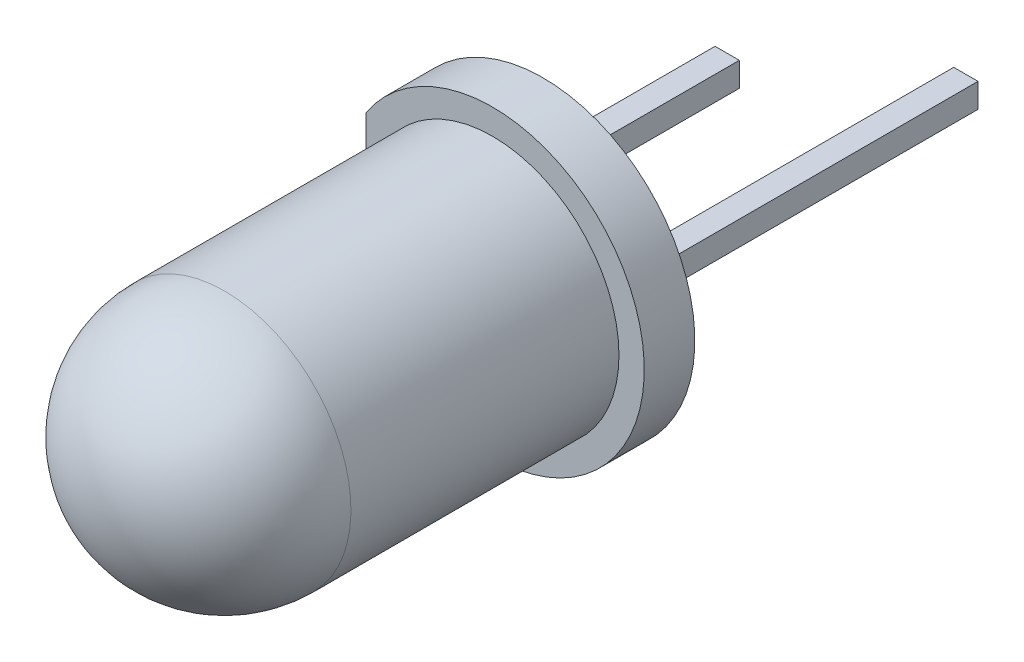
ISO-10303-21;
HEADER;
FILE_DESCRIPTION(('STEP AP214'),'2;1');
FILE_NAME('part.step','',(''),(''),'','','');
FILE_SCHEMA(('AUTOMOTIVE_DESIGN { 1 0 10303 214 1 1 1 1 }'));
ENDSEC;
DATA;
#1=APPLICATION_CONTEXT('core data for automotive mechanical design processes');
#2=APPLICATION_PROTOCOL_DEFINITION('international standard','automotive_design',2000,#1);
#3=PRODUCT_CONTEXT('',#1,'mechanical');
#4=PRODUCT('Part','Part','',(#3));
#5=PRODUCT_RELATED_PRODUCT_CATEGORY('part','',(#4));
#6=PRODUCT_DEFINITION_FORMATION('','',#4);
#7=PRODUCT_DEFINITION_CONTEXT('part definition',#1,'design');
#8=PRODUCT_DEFINITION('design','',#6,#7);
#9=PRODUCT_DEFINITION_SHAPE('','',#8);
#10=(LENGTH_UNIT() NAMED_UNIT(*) SI_UNIT(.MILLI.,.METRE.));
#11=(NAMED_UNIT(*) PLANE_ANGLE_UNIT() SI_UNIT($,.RADIAN.));
#12=(NAMED_UNIT(*) SI_UNIT($,.STERADIAN.) SOLID_ANGLE_UNIT());
#13=UNCERTAINTY_MEASURE_WITH_UNIT(LENGTH_MEASURE(1.E-05),#10,'distance_accuracy_value','');
#14=(GEOMETRIC_REPRESENTATION_CONTEXT(3) GLOBAL_UNCERTAINTY_ASSIGNED_CONTEXT((#13)) GLOBAL_UNIT_ASSIGNED_CONTEXT((#10,
#11,#12)) REPRESENTATION_CONTEXT('',''));
#15=CARTESIAN_POINT('',(0.,0.,0.));
#16=DIRECTION('',(0.,0.,1.));
#17=DIRECTION('',(1.,0.,0.));
#18=AXIS2_PLACEMENT_3D('',#15,#16,#17);
#19=CARTESIAN_POINT('',(-0.0499999999999997,0.,4.26666666666667));
#20=DIRECTION('',(0.,0.,1.));
#21=DIRECTION('',(-1.,0.,0.));
#22=AXIS2_PLACEMENT_3D('',#19,#20,#21);
#23=SPHERICAL_SURFACE('',#22,0.566666666666667);
#24=CARTESIAN_POINT('',(-0.0499999999999997,-0.24,4.26666666666667));
#25=DIRECTION('',(0.,1.,0.));
#26=DIRECTION('',(0.,0.,1.));
#27=AXIS2_PLACEMENT_3D('',#24,#25,#26);
#28=CIRCLE('',#27,0.513333333333333);
#29=CARTESIAN_POINT('',(-0.488634243989226,-0.24,4.));
#30=VERTEX_POINT('',#29);
#31=CARTESIAN_POINT('',(0.388634243989226,-0.24,4.));
#32=VERTEX_POINT('',#31);
#33=EDGE_CURVE('E162',#30,#32,#28,.F.);
#34=ORIENTED_EDGE('',*,*,#33,.T.);
#35=CARTESIAN_POINT('',(-0.0499999999999997,0.,4.));
#36=DIRECTION('',(0.,0.,1.));
#37=DIRECTION('',(1.,0.,0.));
#38=AXIS2_PLACEMENT_3D('',#35,#36,#37);
#39=CIRCLE('',#38,0.5);
#40=EDGE_CURVE('E57',#30,#32,#39,.T.);
#41=ORIENTED_EDGE('',*,*,#40,.F.);
#42=EDGE_LOOP('',(#34,#41));
#43=FACE_BOUND('',#42,.T.);
#44=ADVANCED_FACE('F49',(#43),#23,.T.);
#45=CARTESIAN_POINT('',(0.388634243989226,0.24,4.));
#46=VERTEX_POINT('',#45);
#47=CARTESIAN_POINT('',(-0.488634243989226,0.24,4.));
#48=VERTEX_POINT('',#47);
#49=EDGE_CURVE('E12',#46,#48,#39,.T.);
#50=ORIENTED_EDGE('',*,*,#49,.F.);
#51=CARTESIAN_POINT('',(-0.0499999999999997,0.24,4.26666666666667));
#52=DIRECTION('',(0.,1.,0.));
#53=DIRECTION('',(0.,0.,1.));
#54=AXIS2_PLACEMENT_3D('',#51,#52,#53);
#55=CIRCLE('',#54,0.513333333333333);
#56=EDGE_CURVE('E184',#48,#46,#55,.F.);
#57=ORIENTED_EDGE('',*,*,#56,.F.);
#58=EDGE_LOOP('',(#50,#57));
#59=FACE_BOUND('',#58,.T.);
#60=ADVANCED_FACE('F51',(#59),#23,.T.);
#61=CARTESIAN_POINT('',(-0.55,0.,4.));
#62=DIRECTION('',(0.,0.,-1.));
#63=DIRECTION('',(-1.,0.,0.));
#64=AXIS2_PLACEMENT_3D('',#61,#62,#63);
#65=PLANE('',#64);
#66=CARTESIAN_POINT('',(-0.0499999999999997,0.,4.));
#67=DIRECTION('',(0.,0.,1.));
#68=DIRECTION('',(1.,0.,0.));
#69=AXIS2_PLACEMENT_3D('',#66,#67,#68);
#70=CIRCLE('',#69,0.2);
#71=CARTESIAN_POINT('',(0.15,0.,4.));
#72=VERTEX_POINT('',#71);
#73=EDGE_CURVE('E257',#72,#72,#70,.T.);
#74=ORIENTED_EDGE('',*,*,#73,.F.);
#75=EDGE_LOOP('',(#74));
#76=FACE_BOUND('',#75,.T.);
#77=ORIENTED_EDGE('',*,*,#49,.T.);
#78=DIRECTION('',(1.,0.,0.));
#79=VECTOR('',#78,1.);
#80=CARTESIAN_POINT('',(-1.3,0.24,4.));
#81=LINE('',#80,#79);
#82=CARTESIAN_POINT('',(-1.3,0.24,4.));
#83=VERTEX_POINT('',#82);
#84=EDGE_CURVE('E103',#83,#48,#81,.T.);
#85=ORIENTED_EDGE('',*,*,#84,.F.);
#86=DIRECTION('',(0.,-1.,0.));
#87=VECTOR('',#86,1.);
#88=CARTESIAN_POINT('',(-1.3,0.24,4.));
#89=LINE('',#88,#87);
#90=CARTESIAN_POINT('',(-1.3,-0.24,4.));
#91=VERTEX_POINT('',#90);
#92=EDGE_CURVE('E161',#83,#91,#89,.T.);
#93=ORIENTED_EDGE('',*,*,#92,.T.);
#94=DIRECTION('',(1.,0.,0.));
#95=VECTOR('',#94,1.);
#96=CARTESIAN_POINT('',(-1.3,-0.24,4.));
#97=LINE('',#96,#95);
#98=EDGE_CURVE('E64',#91,#30,#97,.T.);
#99=ORIENTED_EDGE('',*,*,#98,.T.);
#100=ORIENTED_EDGE('',*,*,#40,.T.);
#101=CARTESIAN_POINT('',(1.2,-0.24,4.));
#102=VERTEX_POINT('',#101);
#103=EDGE_CURVE('E147',#32,#102,#97,.T.);
#104=ORIENTED_EDGE('',*,*,#103,.T.);
#105=DIRECTION('',(0.,-1.,0.));
#106=VECTOR('',#105,1.);
#107=CARTESIAN_POINT('',(1.2,0.24,4.));
#108=LINE('',#107,#106);
#109=CARTESIAN_POINT('',(1.2,0.24,4.));
#110=VERTEX_POINT('',#109);
#111=EDGE_CURVE('E131',#110,#102,#108,.T.);
#112=ORIENTED_EDGE('',*,*,#111,.F.);
#113=EDGE_CURVE('E119',#46,#110,#81,.T.);
#114=ORIENTED_EDGE('',*,*,#113,.F.);
#115=EDGE_LOOP('',(#77,#85,#93,#99,#100,#104,#112,#114));
#116=FACE_BOUND('',#115,.T.);
#117=ADVANCED_FACE('F167',(#76,#116),#65,.F.);
#118=CARTESIAN_POINT('',(0.,0.24,0.));
#119=DIRECTION('',(0.,1.,0.));
#120=DIRECTION('',(0.,0.,1.));
#121=AXIS2_PLACEMENT_3D('',#118,#119,#120);
#122=PLANE('',#121);
#123=ORIENTED_EDGE('',*,*,#84,.T.);
#124=ORIENTED_EDGE('',*,*,#56,.T.);
#125=ORIENTED_EDGE('',*,*,#113,.T.);
#126=DIRECTION('',(-0.508148861978286,0.,-0.861269257590315));
#127=VECTOR('',#126,1.);
#128=CARTESIAN_POINT('',(1.2,0.24,4.));
#129=LINE('',#128,#127);
#130=CARTESIAN_POINT('',(0.0199999999999998,0.24,2.));
#131=VERTEX_POINT('',#130);
#132=EDGE_CURVE('E110',#110,#131,#129,.T.);
#133=ORIENTED_EDGE('',*,*,#132,.T.);
#134=DIRECTION('',(-1.,0.,0.));
#135=VECTOR('',#134,1.);
#136=CARTESIAN_POINT('',(0.0199999999999998,0.24,2.));
#137=LINE('',#136,#135);
#138=CARTESIAN_POINT('',(-1.12,0.24,2.));
#139=VERTEX_POINT('',#138);
#140=EDGE_CURVE('E115',#131,#139,#137,.T.);
#141=ORIENTED_EDGE('',*,*,#140,.T.);
#142=DIRECTION('',(0.,0.,-1.));
#143=VECTOR('',#142,1.);
#144=CARTESIAN_POINT('',(-1.12,0.24,2.));
#145=LINE('',#144,#143);
#146=CARTESIAN_POINT('',(-1.12,0.24,-5.));
#147=VERTEX_POINT('',#146);
#148=EDGE_CURVE('E137',#139,#147,#145,.T.);
#149=ORIENTED_EDGE('',*,*,#148,.T.);
#150=DIRECTION('',(1.,0.,0.));
#151=VECTOR('',#150,1.);
#152=CARTESIAN_POINT('',(-1.12,0.24,-5.));
#153=LINE('',#152,#151);
#154=CARTESIAN_POINT('',(-1.6,0.24,-5.));
#155=VERTEX_POINT('',#154);
#156=EDGE_CURVE('E148',#155,#147,#153,.T.);
#157=ORIENTED_EDGE('',*,*,#156,.F.);
#158=DIRECTION('',(0.,0.,1.));
#159=VECTOR('',#158,1.);
#160=CARTESIAN_POINT('',(-1.6,0.24,0.));
#161=LINE('',#160,#159);
#162=CARTESIAN_POINT('',(-1.6,0.24,3.5));
#163=VERTEX_POINT('',#162);
#164=EDGE_CURVE('E73',#155,#163,#161,.T.);
#165=ORIENTED_EDGE('',*,*,#164,.T.);
#166=DIRECTION('',(0.514495755427526,0.,0.857492925712544));
#167=VECTOR('',#166,1.);
#168=CARTESIAN_POINT('',(-1.6,0.24,3.5));
#169=LINE('',#168,#167);
#170=EDGE_CURVE('E157',#163,#83,#169,.T.);
#171=ORIENTED_EDGE('',*,*,#170,.T.);
#172=EDGE_LOOP('',(#123,#124,#125,#133,#141,#149,#157,#165,#171));
#173=FACE_BOUND('',#172,.T.);
#174=ADVANCED_FACE('F112',(#173),#122,.T.);
#175=CARTESIAN_POINT('',(0.,-0.24,0.));
#176=DIRECTION('',(0.,1.,0.));
#177=DIRECTION('',(0.,0.,1.));
#178=AXIS2_PLACEMENT_3D('',#175,#176,#177);
#179=PLANE('',#178);
#180=ORIENTED_EDGE('',*,*,#33,.F.);
#181=ORIENTED_EDGE('',*,*,#98,.F.);
#182=DIRECTION('',(0.514495755427526,0.,0.857492925712544));
#183=VECTOR('',#182,1.);
#184=CARTESIAN_POINT('',(-1.6,-0.24,3.5));
#185=LINE('',#184,#183);
#186=CARTESIAN_POINT('',(-1.6,-0.24,3.5));
#187=VERTEX_POINT('',#186);
#188=EDGE_CURVE('E144',#187,#91,#185,.T.);
#189=ORIENTED_EDGE('',*,*,#188,.F.);
#190=DIRECTION('',(0.,0.,1.));
#191=VECTOR('',#190,1.);
#192=CARTESIAN_POINT('',(-1.6,-0.24,0.));
#193=LINE('',#192,#191);
#194=CARTESIAN_POINT('',(-1.6,-0.24,-5.));
#195=VERTEX_POINT('',#194);
#196=EDGE_CURVE('E97',#195,#187,#193,.T.);
#197=ORIENTED_EDGE('',*,*,#196,.F.);
#198=DIRECTION('',(-1.,0.,0.));
#199=VECTOR('',#198,1.);
#200=CARTESIAN_POINT('',(-1.12,-0.24,-5.));
#201=LINE('',#200,#199);
#202=CARTESIAN_POINT('',(-1.12,-0.24,-5.));
#203=VERTEX_POINT('',#202);
#204=EDGE_CURVE('E205',#203,#195,#201,.T.);
#205=ORIENTED_EDGE('',*,*,#204,.F.);
#206=DIRECTION('',(0.,0.,-1.));
#207=VECTOR('',#206,1.);
#208=CARTESIAN_POINT('',(-1.12,-0.24,2.));
#209=LINE('',#208,#207);
#210=CARTESIAN_POINT('',(-1.12,-0.24,2.));
#211=VERTEX_POINT('',#210);
#212=EDGE_CURVE('E153',#211,#203,#209,.T.);
#213=ORIENTED_EDGE('',*,*,#212,.F.);
#214=DIRECTION('',(-1.,0.,0.));
#215=VECTOR('',#214,1.);
#216=CARTESIAN_POINT('',(0.0199999999999998,-0.24,2.));
#217=LINE('',#216,#215);
#218=CARTESIAN_POINT('',(0.0199999999999998,-0.24,2.));
#219=VERTEX_POINT('',#218);
#220=EDGE_CURVE('E151',#219,#211,#217,.T.);
#221=ORIENTED_EDGE('',*,*,#220,.F.);
#222=DIRECTION('',(-0.508148861978286,0.,-0.861269257590315));
#223=VECTOR('',#222,1.);
#224=CARTESIAN_POINT('',(1.2,-0.24,4.));
#225=LINE('',#224,#223);
#226=EDGE_CURVE('E128',#102,#219,#225,.T.);
#227=ORIENTED_EDGE('',*,*,#226,.F.);
#228=ORIENTED_EDGE('',*,*,#103,.F.);
#229=EDGE_LOOP('',(#180,#181,#189,#197,#205,#213,#221,#227,#228));
#230=FACE_BOUND('',#229,.T.);
#231=ADVANCED_FACE('F219',(#230),#179,.F.);
#232=CARTESIAN_POINT('',(-1.6,0.24,3.5));
#233=DIRECTION('',(0.857492925712544,0.,-0.514495755427526));
#234=DIRECTION('',(-0.514495755427526,0.,-0.857492925712544));
#235=AXIS2_PLACEMENT_3D('',#232,#233,#234);
#236=PLANE('',#235);
#237=ORIENTED_EDGE('',*,*,#188,.T.);
#238=ORIENTED_EDGE('',*,*,#92,.F.);
#239=ORIENTED_EDGE('',*,*,#170,.F.);
#240=DIRECTION('',(0.,-1.,0.));
#241=VECTOR('',#240,1.);
#242=CARTESIAN_POINT('',(-1.6,0.24,3.5));
#243=LINE('',#242,#241);
#244=EDGE_CURVE('E143',#163,#187,#243,.T.);
#245=ORIENTED_EDGE('',*,*,#244,.T.);
#246=EDGE_LOOP('',(#237,#238,#239,#245));
#247=FACE_BOUND('',#246,.T.);
#248=ADVANCED_FACE('F216',(#247),#236,.F.);
#249=CARTESIAN_POINT('',(1.2,0.24,4.));
#250=DIRECTION('',(-0.861269257590315,0.,0.508148861978286));
#251=DIRECTION('',(0.508148861978286,0.,0.861269257590315));
#252=AXIS2_PLACEMENT_3D('',#249,#250,#251);
#253=PLANE('',#252);
#254=ORIENTED_EDGE('',*,*,#226,.T.);
#255=DIRECTION('',(0.,-1.,0.));
#256=VECTOR('',#255,1.);
#257=CARTESIAN_POINT('',(0.0199999999999998,0.24,2.));
#258=LINE('',#257,#256);
#259=EDGE_CURVE('E125',#131,#219,#258,.T.);
#260=ORIENTED_EDGE('',*,*,#259,.F.);
#261=ORIENTED_EDGE('',*,*,#132,.F.);
#262=ORIENTED_EDGE('',*,*,#111,.T.);
#263=EDGE_LOOP('',(#254,#260,#261,#262));
#264=FACE_BOUND('',#263,.T.);
#265=ADVANCED_FACE('F126',(#264),#253,.F.);
#266=CARTESIAN_POINT('',(0.0199999999999998,0.24,2.));
#267=DIRECTION('',(0.,0.,1.));
#268=DIRECTION('',(1.,0.,0.));
#269=AXIS2_PLACEMENT_3D('',#266,#267,#268);
#270=PLANE('',#269);
#271=ORIENTED_EDGE('',*,*,#220,.T.);
#272=DIRECTION('',(0.,-1.,0.));
#273=VECTOR('',#272,1.);
#274=CARTESIAN_POINT('',(-1.12,0.24,2.));
#275=LINE('',#274,#273);
#276=EDGE_CURVE('E132',#139,#211,#275,.T.);
#277=ORIENTED_EDGE('',*,*,#276,.F.);
#278=ORIENTED_EDGE('',*,*,#140,.F.);
#279=ORIENTED_EDGE('',*,*,#259,.T.);
#280=EDGE_LOOP('',(#271,#277,#278,#279));
#281=FACE_BOUND('',#280,.T.);
#282=ADVANCED_FACE('F134',(#281),#270,.F.);
#283=CARTESIAN_POINT('',(-1.12,0.24,2.));
#284=DIRECTION('',(-1.,0.,0.));
#285=DIRECTION('',(0.,0.,1.));
#286=AXIS2_PLACEMENT_3D('',#283,#284,#285);
#287=PLANE('',#286);
#288=ORIENTED_EDGE('',*,*,#212,.T.);
#289=DIRECTION('',(0.,-1.,0.));
#290=VECTOR('',#289,1.);
#291=CARTESIAN_POINT('',(-1.12,-0.24,-5.));
#292=LINE('',#291,#290);
#293=EDGE_CURVE('E199',#147,#203,#292,.T.);
#294=ORIENTED_EDGE('',*,*,#293,.F.);
#295=ORIENTED_EDGE('',*,*,#148,.F.);
#296=ORIENTED_EDGE('',*,*,#276,.T.);
#297=EDGE_LOOP('',(#288,#294,#295,#296));
#298=FACE_BOUND('',#297,.T.);
#299=ADVANCED_FACE('F202',(#298),#287,.F.);
#300=CARTESIAN_POINT('',(-1.6,0.24,0.));
#301=DIRECTION('',(1.,0.,0.));
#302=DIRECTION('',(0.,0.,-1.));
#303=AXIS2_PLACEMENT_3D('',#300,#301,#302);
#304=PLANE('',#303);
#305=ORIENTED_EDGE('',*,*,#196,.T.);
#306=ORIENTED_EDGE('',*,*,#244,.F.);
#307=ORIENTED_EDGE('',*,*,#164,.F.);
#308=DIRECTION('',(0.,1.,0.));
#309=VECTOR('',#308,1.);
#310=CARTESIAN_POINT('',(-1.6,-0.24,-5.));
#311=LINE('',#310,#309);
#312=EDGE_CURVE('E200',#195,#155,#311,.T.);
#313=ORIENTED_EDGE('',*,*,#312,.F.);
#314=EDGE_LOOP('',(#305,#306,#307,#313));
#315=FACE_BOUND('',#314,.T.);
#316=ADVANCED_FACE('F220',(#315),#304,.F.);
#317=CARTESIAN_POINT('',(0.,0.,-5.));
#318=DIRECTION('',(0.,0.,1.));
#319=DIRECTION('',(1.,0.,0.));
#320=AXIS2_PLACEMENT_3D('',#317,#318,#319);
#321=PLANE('',#320);
#322=ORIENTED_EDGE('',*,*,#293,.T.);
#323=ORIENTED_EDGE('',*,*,#204,.T.);
#324=ORIENTED_EDGE('',*,*,#312,.T.);
#325=ORIENTED_EDGE('',*,*,#156,.T.);
#326=EDGE_LOOP('',(#322,#323,#324,#325));
#327=FACE_BOUND('',#326,.T.);
#328=ADVANCED_FACE('F197',(#327),#321,.F.);
#329=CARTESIAN_POINT('',(-0.0499999999999997,0.,3.9));
#330=DIRECTION('',(0.,0.,1.));
#331=DIRECTION('',(1.,0.,0.));
#332=AXIS2_PLACEMENT_3D('',#329,#330,#331);
#333=CYLINDRICAL_SURFACE('',#332,0.2);
#334=CARTESIAN_POINT('',(-0.0499999999999997,0.,3.9));
#335=DIRECTION('',(0.,0.,1.));
#336=DIRECTION('',(1.,0.,0.));
#337=AXIS2_PLACEMENT_3D('',#334,#335,#336);
#338=CIRCLE('',#337,0.2);
#339=CARTESIAN_POINT('',(0.15,0.,3.9));
#340=VERTEX_POINT('',#339);
#341=EDGE_CURVE('E208',#340,#340,#338,.T.);
#342=ORIENTED_EDGE('',*,*,#341,.F.);
#343=EDGE_LOOP('',(#342));
#344=FACE_BOUND('',#343,.T.);
#345=ORIENTED_EDGE('',*,*,#73,.T.);
#346=EDGE_LOOP('',(#345));
#347=FACE_BOUND('',#346,.T.);
#348=ADVANCED_FACE('F227',(#344,#347),#333,.F.);
#349=CARTESIAN_POINT('',(-0.0499999999999997,0.,3.9));
#350=DIRECTION('',(0.,0.,1.));
#351=DIRECTION('',(1.,0.,0.));
#352=AXIS2_PLACEMENT_3D('',#349,#350,#351);
#353=PLANE('',#352);
#354=ORIENTED_EDGE('',*,*,#341,.T.);
#355=EDGE_LOOP('',(#354));
#356=FACE_BOUND('',#355,.T.);
#357=ADVANCED_FACE('F249',(#356),#353,.T.);
#358=CLOSED_SHELL('',(#44,#60,#117,#174,#231,#248,#265,#282,#299,#316,#328,#348,#357));
#359=MANIFOLD_SOLID_BREP('B2',#358);
#360=CARTESIAN_POINT('',(1.12,0.24,2.));
#361=DIRECTION('',(0.,0.,1.));
#362=DIRECTION('',(1.,0.,0.));
#363=AXIS2_PLACEMENT_3D('',#360,#361,#362);
#364=PLANE('',#363);
#365=DIRECTION('',(-1.,0.,0.));
#366=VECTOR('',#365,1.);
#367=CARTESIAN_POINT('',(1.12,-0.24,2.));
#368=LINE('',#367,#366);
#369=CARTESIAN_POINT('',(1.12,-0.24,2.));
#370=VERTEX_POINT('',#369);
#371=CARTESIAN_POINT('',(0.22,-0.24,2.));
#372=VERTEX_POINT('',#371);
#373=EDGE_CURVE('E454',#370,#372,#368,.T.);
#374=ORIENTED_EDGE('',*,*,#373,.T.);
#375=DIRECTION('',(0.,-1.,0.));
#376=VECTOR('',#375,1.);
#377=CARTESIAN_POINT('',(0.22,0.24,2.));
#378=LINE('',#377,#376);
#379=CARTESIAN_POINT('',(0.22,0.24,2.));
#380=VERTEX_POINT('',#379);
#381=EDGE_CURVE('E47',#380,#372,#378,.T.);
#382=ORIENTED_EDGE('',*,*,#381,.F.);
#383=DIRECTION('',(-1.,0.,0.));
#384=VECTOR('',#383,1.);
#385=CARTESIAN_POINT('',(1.12,0.24,2.));
#386=LINE('',#385,#384);
#387=CARTESIAN_POINT('',(1.12,0.24,2.));
#388=VERTEX_POINT('',#387);
#389=EDGE_CURVE('E455',#388,#380,#386,.T.);
#390=ORIENTED_EDGE('',*,*,#389,.F.);
#391=DIRECTION('',(0.,-1.,0.));
#392=VECTOR('',#391,1.);
#393=CARTESIAN_POINT('',(1.12,0.24,2.));
#394=LINE('',#393,#392);
#395=EDGE_CURVE('E460',#388,#370,#394,.T.);
#396=ORIENTED_EDGE('',*,*,#395,.T.);
#397=EDGE_LOOP('',(#374,#382,#390,#396));
#398=FACE_BOUND('',#397,.T.);
#399=ADVANCED_FACE('F368',(#398),#364,.F.);
#400=CARTESIAN_POINT('',(0.22,0.24,2.));
#401=DIRECTION('',(0.861269257590315,0.,-0.508148861978286));
#402=DIRECTION('',(-0.508148861978286,0.,-0.861269257590315));
#403=AXIS2_PLACEMENT_3D('',#400,#401,#402);
#404=PLANE('',#403);
#405=DIRECTION('',(0.508148861978286,0.,0.861269257590315));
#406=VECTOR('',#405,1.);
#407=CARTESIAN_POINT('',(0.22,-0.24,2.));
#408=LINE('',#407,#406);
#409=CARTESIAN_POINT('',(1.4,-0.24,4.));
#410=VERTEX_POINT('',#409);
#411=EDGE_CURVE('E463',#372,#410,#408,.T.);
#412=ORIENTED_EDGE('',*,*,#411,.T.);
#413=DIRECTION('',(0.,-1.,0.));
#414=VECTOR('',#413,1.);
#415=CARTESIAN_POINT('',(1.4,0.24,4.));
#416=LINE('',#415,#414);
#417=CARTESIAN_POINT('',(1.4,0.24,4.));
#418=VERTEX_POINT('',#417);
#419=EDGE_CURVE('E376',#418,#410,#416,.T.);
#420=ORIENTED_EDGE('',*,*,#419,.F.);
#421=DIRECTION('',(0.508148861978286,0.,0.861269257590315));
#422=VECTOR('',#421,1.);
#423=CARTESIAN_POINT('',(0.22,0.24,2.));
#424=LINE('',#423,#422);
#425=EDGE_CURVE('E417',#380,#418,#424,.T.);
#426=ORIENTED_EDGE('',*,*,#425,.F.);
#427=ORIENTED_EDGE('',*,*,#381,.T.);
#428=EDGE_LOOP('',(#412,#420,#426,#427));
#429=FACE_BOUND('',#428,.T.);
#430=ADVANCED_FACE('F478',(#429),#404,.F.);
#431=CARTESIAN_POINT('',(1.4,0.24,4.));
#432=DIRECTION('',(0.,0.,-1.));
#433=DIRECTION('',(-1.,0.,0.));
#434=AXIS2_PLACEMENT_3D('',#431,#432,#433);
#435=PLANE('',#434);
#436=DIRECTION('',(1.,0.,0.));
#437=VECTOR('',#436,1.);
#438=CARTESIAN_POINT('',(1.4,-0.24,4.));
#439=LINE('',#438,#437);
#440=CARTESIAN_POINT('',(1.6,-0.24,4.));
#441=VERTEX_POINT('',#440);
#442=EDGE_CURVE('E403',#410,#441,#439,.T.);
#443=ORIENTED_EDGE('',*,*,#442,.T.);
#444=DIRECTION('',(0.,-1.,0.));
#445=VECTOR('',#444,1.);
#446=CARTESIAN_POINT('',(1.6,0.24,4.));
#447=LINE('',#446,#445);
#448=CARTESIAN_POINT('',(1.6,0.24,4.));
#449=VERTEX_POINT('',#448);
#450=EDGE_CURVE('E469',#449,#441,#447,.T.);
#451=ORIENTED_EDGE('',*,*,#450,.F.);
#452=DIRECTION('',(1.,0.,0.));
#453=VECTOR('',#452,1.);
#454=CARTESIAN_POINT('',(1.4,0.24,4.));
#455=LINE('',#454,#453);
#456=EDGE_CURVE('E434',#418,#449,#455,.T.);
#457=ORIENTED_EDGE('',*,*,#456,.F.);
#458=ORIENTED_EDGE('',*,*,#419,.T.);
#459=EDGE_LOOP('',(#443,#451,#457,#458));
#460=FACE_BOUND('',#459,.T.);
#461=ADVANCED_FACE('F470',(#460),#435,.F.);
#462=CARTESIAN_POINT('',(1.6,0.24,4.));
#463=DIRECTION('',(-1.,0.,0.));
#464=DIRECTION('',(0.,0.,1.));
#465=AXIS2_PLACEMENT_3D('',#462,#463,#464);
#466=PLANE('',#465);
#467=DIRECTION('',(0.,0.,-1.));
#468=VECTOR('',#467,1.);
#469=CARTESIAN_POINT('',(1.6,-0.24,4.));
#470=LINE('',#469,#468);
#471=CARTESIAN_POINT('',(1.6,-0.24,-7.));
#472=VERTEX_POINT('',#471);
#473=EDGE_CURVE('E441',#441,#472,#470,.T.);
#474=ORIENTED_EDGE('',*,*,#473,.T.);
#475=DIRECTION('',(0.,-1.,0.));
#476=VECTOR('',#475,1.);
#477=CARTESIAN_POINT('',(1.6,0.24,-7.));
#478=LINE('',#477,#476);
#479=CARTESIAN_POINT('',(1.6,0.24,-7.));
#480=VERTEX_POINT('',#479);
#481=EDGE_CURVE('E438',#480,#472,#478,.T.);
#482=ORIENTED_EDGE('',*,*,#481,.F.);
#483=DIRECTION('',(0.,0.,-1.));
#484=VECTOR('',#483,1.);
#485=CARTESIAN_POINT('',(1.6,0.24,4.));
#486=LINE('',#485,#484);
#487=EDGE_CURVE('E428',#449,#480,#486,.T.);
#488=ORIENTED_EDGE('',*,*,#487,.F.);
#489=ORIENTED_EDGE('',*,*,#450,.T.);
#490=EDGE_LOOP('',(#474,#482,#488,#489));
#491=FACE_BOUND('',#490,.T.);
#492=ADVANCED_FACE('F439',(#491),#466,.F.);
#493=CARTESIAN_POINT('',(1.12,0.24,0.));
#494=DIRECTION('',(1.,0.,0.));
#495=DIRECTION('',(0.,0.,-1.));
#496=AXIS2_PLACEMENT_3D('',#493,#494,#495);
#497=PLANE('',#496);
#498=DIRECTION('',(0.,0.,1.));
#499=VECTOR('',#498,1.);
#500=CARTESIAN_POINT('',(1.12,-0.24,0.));
#501=LINE('',#500,#499);
#502=CARTESIAN_POINT('',(1.12,-0.24,-7.));
#503=VERTEX_POINT('',#502);
#504=EDGE_CURVE('E410',#503,#370,#501,.T.);
#505=ORIENTED_EDGE('',*,*,#504,.T.);
#506=ORIENTED_EDGE('',*,*,#395,.F.);
#507=DIRECTION('',(0.,0.,1.));
#508=VECTOR('',#507,1.);
#509=CARTESIAN_POINT('',(1.12,0.24,0.));
#510=LINE('',#509,#508);
#511=CARTESIAN_POINT('',(1.12,0.24,-7.));
#512=VERTEX_POINT('',#511);
#513=EDGE_CURVE('E384',#512,#388,#510,.T.);
#514=ORIENTED_EDGE('',*,*,#513,.F.);
#515=DIRECTION('',(0.,1.,0.));
#516=VECTOR('',#515,1.);
#517=CARTESIAN_POINT('',(1.12,-0.24,-7.));
#518=LINE('',#517,#516);
#519=EDGE_CURVE('E449',#503,#512,#518,.T.);
#520=ORIENTED_EDGE('',*,*,#519,.F.);
#521=EDGE_LOOP('',(#505,#506,#514,#520));
#522=FACE_BOUND('',#521,.T.);
#523=ADVANCED_FACE('F474',(#522),#497,.F.);
#524=CARTESIAN_POINT('',(0.,0.24,0.));
#525=DIRECTION('',(0.,-1.,0.));
#526=DIRECTION('',(0.,0.,-1.));
#527=AXIS2_PLACEMENT_3D('',#524,#525,#526);
#528=PLANE('',#527);
#529=ORIENTED_EDGE('',*,*,#389,.T.);
#530=ORIENTED_EDGE('',*,*,#425,.T.);
#531=ORIENTED_EDGE('',*,*,#456,.T.);
#532=ORIENTED_EDGE('',*,*,#487,.T.);
#533=DIRECTION('',(1.,0.,0.));
#534=VECTOR('',#533,1.);
#535=CARTESIAN_POINT('',(1.12,0.24,-7.));
#536=LINE('',#535,#534);
#537=EDGE_CURVE('E432',#512,#480,#536,.T.);
#538=ORIENTED_EDGE('',*,*,#537,.F.);
#539=ORIENTED_EDGE('',*,*,#513,.T.);
#540=EDGE_LOOP('',(#529,#530,#531,#532,#538,#539));
#541=FACE_BOUND('',#540,.T.);
#542=ADVANCED_FACE('F430',(#541),#528,.F.);
#543=CARTESIAN_POINT('',(0.,-0.24,0.));
#544=DIRECTION('',(0.,-1.,0.));
#545=DIRECTION('',(0.,0.,-1.));
#546=AXIS2_PLACEMENT_3D('',#543,#544,#545);
#547=PLANE('',#546);
#548=ORIENTED_EDGE('',*,*,#373,.F.);
#549=ORIENTED_EDGE('',*,*,#504,.F.);
#550=DIRECTION('',(-1.,0.,0.));
#551=VECTOR('',#550,1.);
#552=CARTESIAN_POINT('',(1.6,-0.24,-7.));
#553=LINE('',#552,#551);
#554=EDGE_CURVE('E445',#472,#503,#553,.T.);
#555=ORIENTED_EDGE('',*,*,#554,.F.);
#556=ORIENTED_EDGE('',*,*,#473,.F.);
#557=ORIENTED_EDGE('',*,*,#442,.F.);
#558=ORIENTED_EDGE('',*,*,#411,.F.);
#559=EDGE_LOOP('',(#548,#549,#555,#556,#557,#558));
#560=FACE_BOUND('',#559,.T.);
#561=ADVANCED_FACE('F473',(#560),#547,.T.);
#562=CARTESIAN_POINT('',(0.,0.,-7.));
#563=DIRECTION('',(0.,0.,-1.));
#564=DIRECTION('',(-1.,0.,0.));
#565=AXIS2_PLACEMENT_3D('',#562,#563,#564);
#566=PLANE('',#565);
#567=ORIENTED_EDGE('',*,*,#537,.T.);
#568=ORIENTED_EDGE('',*,*,#481,.T.);
#569=ORIENTED_EDGE('',*,*,#554,.T.);
#570=ORIENTED_EDGE('',*,*,#519,.T.);
#571=EDGE_LOOP('',(#567,#568,#569,#570));
#572=FACE_BOUND('',#571,.T.);
#573=ADVANCED_FACE('F448',(#572),#566,.T.);
#574=CLOSED_SHELL('',(#399,#430,#461,#492,#523,#542,#561,#573));
#575=MANIFOLD_SOLID_BREP('B6',#574);
#576=CARTESIAN_POINT('',(0.,0.,1.));
#577=DIRECTION('',(0.,0.,-1.));
#578=DIRECTION('',(-1.,0.,0.));
#579=AXIS2_PLACEMENT_3D('',#576,#577,#578);
#580=CYLINDRICAL_SURFACE('',#579,3.);
#581=CARTESIAN_POINT('',(0.,0.,1.));
#582=DIRECTION('',(0.,0.,1.));
#583=DIRECTION('',(1.,0.,0.));
#584=AXIS2_PLACEMENT_3D('',#581,#582,#583);
#585=CIRCLE('',#584,3.);
#586=CARTESIAN_POINT('',(-2.5,-1.6583123951777,1.));
#587=VERTEX_POINT('',#586);
#588=CARTESIAN_POINT('',(-2.5,1.6583123951777,1.));
#589=VERTEX_POINT('',#588);
#590=EDGE_CURVE('E579',#587,#589,#585,.T.);
#591=ORIENTED_EDGE('',*,*,#590,.F.);
#592=DIRECTION('',(0.,0.,-1.));
#593=VECTOR('',#592,1.);
#594=CARTESIAN_POINT('',(-2.5,-1.6583123951777,4.35410196624969));
#595=LINE('',#594,#593);
#596=CARTESIAN_POINT('',(-2.5,-1.6583123951777,0.));
#597=VERTEX_POINT('',#596);
#598=EDGE_CURVE('E777',#587,#597,#595,.T.);
#599=ORIENTED_EDGE('',*,*,#598,.T.);
#600=CARTESIAN_POINT('',(0.,0.,0.));
#601=DIRECTION('',(0.,0.,1.));
#602=DIRECTION('',(1.,0.,0.));
#603=AXIS2_PLACEMENT_3D('',#600,#601,#602);
#604=CIRCLE('',#603,3.);
#605=CARTESIAN_POINT('',(-2.5,1.6583123951777,0.));
#606=VERTEX_POINT('',#605);
#607=EDGE_CURVE('E785',#597,#606,#604,.T.);
#608=ORIENTED_EDGE('',*,*,#607,.T.);
#609=DIRECTION('',(0.,0.,-1.));
#610=VECTOR('',#609,1.);
#611=CARTESIAN_POINT('',(-2.5,1.6583123951777,4.35410196624969));
#612=LINE('',#611,#610);
#613=EDGE_CURVE('E780',#589,#606,#612,.T.);
#614=ORIENTED_EDGE('',*,*,#613,.F.);
#615=EDGE_LOOP('',(#591,#599,#608,#614));
#616=FACE_BOUND('',#615,.T.);
#617=ADVANCED_FACE('F572',(#616),#580,.T.);
#618=CARTESIAN_POINT('',(0.,0.,1.));
#619=DIRECTION('',(0.,0.,1.));
#620=DIRECTION('',(1.,0.,0.));
#621=AXIS2_PLACEMENT_3D('',#618,#619,#620);
#622=PLANE('',#621);
#623=DIRECTION('',(0.,-1.,0.));
#624=VECTOR('',#623,1.);
#625=CARTESIAN_POINT('',(-2.5,1.6583123951777,1.));
#626=LINE('',#625,#624);
#627=CARTESIAN_POINT('',(-2.5,0.,1.));
#628=VERTEX_POINT('',#627);
#629=EDGE_CURVE('E773',#628,#587,#626,.T.);
#630=ORIENTED_EDGE('',*,*,#629,.T.);
#631=ORIENTED_EDGE('',*,*,#590,.T.);
#632=EDGE_CURVE('E774',#589,#628,#626,.T.);
#633=ORIENTED_EDGE('',*,*,#632,.T.);
#634=CARTESIAN_POINT('',(0.,0.,1.));
#635=DIRECTION('',(0.,0.,1.));
#636=DIRECTION('',(1.,0.,0.));
#637=AXIS2_PLACEMENT_3D('',#634,#635,#636);
#638=CIRCLE('',#637,2.5);
#639=EDGE_CURVE('E366',#628,#628,#638,.T.);
#640=ORIENTED_EDGE('',*,*,#639,.F.);
#641=EDGE_LOOP('',(#630,#631,#633,#640));
#642=FACE_BOUND('',#641,.T.);
#643=ADVANCED_FACE('F799',(#642),#622,.T.);
#644=CARTESIAN_POINT('',(0.,0.,0.));
#645=DIRECTION('',(0.,0.,1.));
#646=DIRECTION('',(1.,0.,0.));
#647=AXIS2_PLACEMENT_3D('',#644,#645,#646);
#648=PLANE('',#647);
#649=DIRECTION('',(0.,1.,0.));
#650=VECTOR('',#649,1.);
#651=CARTESIAN_POINT('',(1.12,-0.24,0.));
#652=LINE('',#651,#650);
#653=CARTESIAN_POINT('',(1.12,-0.24,0.));
#654=VERTEX_POINT('',#653);
#655=CARTESIAN_POINT('',(1.12,0.24,0.));
#656=VERTEX_POINT('',#655);
#657=EDGE_CURVE('E686',#654,#656,#652,.T.);
#658=ORIENTED_EDGE('',*,*,#657,.F.);
#659=DIRECTION('',(-1.,0.,0.));
#660=VECTOR('',#659,1.);
#661=CARTESIAN_POINT('',(1.12,-0.24,0.));
#662=LINE('',#661,#660);
#663=CARTESIAN_POINT('',(1.6,-0.24,0.));
#664=VERTEX_POINT('',#663);
#665=EDGE_CURVE('E693',#664,#654,#662,.T.);
#666=ORIENTED_EDGE('',*,*,#665,.F.);
#667=DIRECTION('',(0.,1.,0.));
#668=VECTOR('',#667,1.);
#669=CARTESIAN_POINT('',(1.6,-0.24,0.));
#670=LINE('',#669,#668);
#671=CARTESIAN_POINT('',(1.6,0.24,0.));
#672=VERTEX_POINT('',#671);
#673=EDGE_CURVE('E741',#664,#672,#670,.T.);
#674=ORIENTED_EDGE('',*,*,#673,.T.);
#675=DIRECTION('',(-1.,0.,0.));
#676=VECTOR('',#675,1.);
#677=CARTESIAN_POINT('',(1.12,0.24,0.));
#678=LINE('',#677,#676);
#679=EDGE_CURVE('E707',#672,#656,#678,.T.);
#680=ORIENTED_EDGE('',*,*,#679,.T.);
#681=EDGE_LOOP('',(#658,#666,#674,#680));
#682=FACE_BOUND('',#681,.T.);
#683=DIRECTION('',(0.,1.,0.));
#684=VECTOR('',#683,1.);
#685=CARTESIAN_POINT('',(-1.6,-0.24,0.));
#686=LINE('',#685,#684);
#687=CARTESIAN_POINT('',(-1.6,-0.24,0.));
#688=VERTEX_POINT('',#687);
#689=CARTESIAN_POINT('',(-1.6,0.24,0.));
#690=VERTEX_POINT('',#689);
#691=EDGE_CURVE('E737',#688,#690,#686,.T.);
#692=ORIENTED_EDGE('',*,*,#691,.F.);
#693=DIRECTION('',(-1.,0.,0.));
#694=VECTOR('',#693,1.);
#695=CARTESIAN_POINT('',(-1.6,-0.24,0.));
#696=LINE('',#695,#694);
#697=CARTESIAN_POINT('',(-1.12,-0.24,0.));
#698=VERTEX_POINT('',#697);
#699=EDGE_CURVE('E715',#698,#688,#696,.T.);
#700=ORIENTED_EDGE('',*,*,#699,.F.);
#701=DIRECTION('',(0.,1.,0.));
#702=VECTOR('',#701,1.);
#703=CARTESIAN_POINT('',(-1.12,-0.24,0.));
#704=LINE('',#703,#702);
#705=CARTESIAN_POINT('',(-1.12,0.24,0.));
#706=VERTEX_POINT('',#705);
#707=EDGE_CURVE('E757',#698,#706,#704,.T.);
#708=ORIENTED_EDGE('',*,*,#707,.T.);
#709=DIRECTION('',(-1.,0.,0.));
#710=VECTOR('',#709,1.);
#711=CARTESIAN_POINT('',(-1.6,0.24,0.));
#712=LINE('',#711,#710);
#713=EDGE_CURVE('E738',#706,#690,#712,.T.);
#714=ORIENTED_EDGE('',*,*,#713,.T.);
#715=EDGE_LOOP('',(#692,#700,#708,#714));
#716=FACE_BOUND('',#715,.T.);
#717=ORIENTED_EDGE('',*,*,#607,.F.);
#718=DIRECTION('',(0.,-1.,0.));
#719=VECTOR('',#718,1.);
#720=CARTESIAN_POINT('',(-2.5,1.6583123951777,0.));
#721=LINE('',#720,#719);
#722=EDGE_CURVE('E760',#606,#597,#721,.T.);
#723=ORIENTED_EDGE('',*,*,#722,.F.);
#724=EDGE_LOOP('',(#717,#723));
#725=FACE_BOUND('',#724,.T.);
#726=ADVANCED_FACE('F705',(#682,#716,#725),#648,.F.);
#727=CARTESIAN_POINT('',(0.,0.,6.3));
#728=DIRECTION('',(0.,0.,-1.));
#729=DIRECTION('',(0.,1.,0.));
#730=AXIS2_PLACEMENT_3D('',#727,#728,#729);
#731=SPHERICAL_SURFACE('',#730,2.5);
#732=CARTESIAN_POINT('',(0.,0.,6.3));
#733=DIRECTION('',(0.,0.,-1.));
#734=DIRECTION('',(0.,1.,0.));
#735=AXIS2_PLACEMENT_3D('',#732,#733,#734);
#736=CIRCLE('',#735,2.5);
#737=CARTESIAN_POINT('',(0.,2.5,6.3));
#738=VERTEX_POINT('',#737);
#739=EDGE_CURVE('E782',#738,#738,#736,.T.);
#740=ORIENTED_EDGE('',*,*,#739,.F.);
#741=EDGE_LOOP('',(#740));
#742=FACE_BOUND('',#741,.T.);
#743=ADVANCED_FACE('F803',(#742),#731,.T.);
#744=CARTESIAN_POINT('',(0.,0.,1.));
#745=DIRECTION('',(0.,0.,-1.));
#746=DIRECTION('',(0.,1.,0.));
#747=AXIS2_PLACEMENT_3D('',#744,#745,#746);
#748=CYLINDRICAL_SURFACE('',#747,2.5);
#749=ORIENTED_EDGE('',*,*,#739,.T.);
#750=EDGE_LOOP('',(#749));
#751=FACE_BOUND('',#750,.T.);
#752=ORIENTED_EDGE('',*,*,#639,.T.);
#753=EDGE_LOOP('',(#752));
#754=FACE_BOUND('',#753,.T.);
#755=ADVANCED_FACE('F801',(#751,#754),#748,.T.);
#756=CARTESIAN_POINT('',(-2.5,1.6583123951777,4.35410196624969));
#757=DIRECTION('',(1.,0.,0.));
#758=DIRECTION('',(0.,0.,-1.));
#759=AXIS2_PLACEMENT_3D('',#756,#757,#758);
#760=PLANE('',#759);
#761=ORIENTED_EDGE('',*,*,#613,.T.);
#762=ORIENTED_EDGE('',*,*,#722,.T.);
#763=ORIENTED_EDGE('',*,*,#598,.F.);
#764=ORIENTED_EDGE('',*,*,#629,.F.);
#765=ORIENTED_EDGE('',*,*,#632,.F.);
#766=EDGE_LOOP('',(#761,#762,#763,#764,#765));
#767=FACE_BOUND('',#766,.T.);
#768=ADVANCED_FACE('F795',(#767),#760,.F.);
#769=CARTESIAN_POINT('',(-1.12,-0.24,0.));
#770=DIRECTION('',(1.,0.,0.));
#771=DIRECTION('',(0.,0.,-1.));
#772=AXIS2_PLACEMENT_3D('',#769,#770,#771);
#773=PLANE('',#772);
#774=DIRECTION('',(0.,0.,-1.));
#775=VECTOR('',#774,1.);
#776=CARTESIAN_POINT('',(-1.12,0.24,0.));
#777=LINE('',#776,#775);
#778=CARTESIAN_POINT('',(-1.12,0.24,2.));
#779=VERTEX_POINT('',#778);
#780=EDGE_CURVE('E719',#779,#706,#777,.T.);
#781=ORIENTED_EDGE('',*,*,#780,.T.);
#782=ORIENTED_EDGE('',*,*,#707,.F.);
#783=DIRECTION('',(0.,0.,-1.));
#784=VECTOR('',#783,1.);
#785=CARTESIAN_POINT('',(-1.12,-0.24,0.));
#786=LINE('',#785,#784);
#787=CARTESIAN_POINT('',(-1.12,-0.24,2.));
#788=VERTEX_POINT('',#787);
#789=EDGE_CURVE('E734',#788,#698,#786,.T.);
#790=ORIENTED_EDGE('',*,*,#789,.F.);
#791=DIRECTION('',(0.,1.,0.));
#792=VECTOR('',#791,1.);
#793=CARTESIAN_POINT('',(-1.12,-0.24,2.));
#794=LINE('',#793,#792);
#795=EDGE_CURVE('E761',#788,#779,#794,.T.);
#796=ORIENTED_EDGE('',*,*,#795,.T.);
#797=EDGE_LOOP('',(#781,#782,#790,#796));
#798=FACE_BOUND('',#797,.T.);
#799=ADVANCED_FACE('F810',(#798),#773,.F.);
#800=CARTESIAN_POINT('',(-1.12,-0.24,2.));
#801=DIRECTION('',(0.,0.,-1.));
#802=DIRECTION('',(-1.,0.,0.));
#803=AXIS2_PLACEMENT_3D('',#800,#801,#802);
#804=PLANE('',#803);
#805=DIRECTION('',(-1.,0.,0.));
#806=VECTOR('',#805,1.);
#807=CARTESIAN_POINT('',(-1.12,0.24,2.));
#808=LINE('',#807,#806);
#809=CARTESIAN_POINT('',(0.0199999999999998,0.24,2.));
#810=VERTEX_POINT('',#809);
#811=EDGE_CURVE('E752',#810,#779,#808,.T.);
#812=ORIENTED_EDGE('',*,*,#811,.T.);
#813=ORIENTED_EDGE('',*,*,#795,.F.);
#814=DIRECTION('',(-1.,0.,0.));
#815=VECTOR('',#814,1.);
#816=CARTESIAN_POINT('',(-1.12,-0.24,2.));
#817=LINE('',#816,#815);
#818=CARTESIAN_POINT('',(0.0199999999999998,-0.24,2.));
#819=VERTEX_POINT('',#818);
#820=EDGE_CURVE('E731',#819,#788,#817,.T.);
#821=ORIENTED_EDGE('',*,*,#820,.F.);
#822=DIRECTION('',(0.,1.,0.));
#823=VECTOR('',#822,1.);
#824=CARTESIAN_POINT('',(0.0199999999999998,-0.24,2.));
#825=LINE('',#824,#823);
#826=EDGE_CURVE('E763',#819,#810,#825,.T.);
#827=ORIENTED_EDGE('',*,*,#826,.T.);
#828=EDGE_LOOP('',(#812,#813,#821,#827));
#829=FACE_BOUND('',#828,.T.);
#830=ADVANCED_FACE('F855',(#829),#804,.F.);
#831=CARTESIAN_POINT('',(0.0199999999999998,-0.24,2.));
#832=DIRECTION('',(0.861269257590315,0.,-0.508148861978286));
#833=DIRECTION('',(-0.508148861978286,0.,-0.861269257590315));
#834=AXIS2_PLACEMENT_3D('',#831,#832,#833);
#835=PLANE('',#834);
#836=DIRECTION('',(-0.508148861978286,0.,-0.861269257590315));
#837=VECTOR('',#836,1.);
#838=CARTESIAN_POINT('',(0.0199999999999998,0.24,2.));
#839=LINE('',#838,#837);
#840=CARTESIAN_POINT('',(1.2,0.24,4.));
#841=VERTEX_POINT('',#840);
#842=EDGE_CURVE('E749',#841,#810,#839,.T.);
#843=ORIENTED_EDGE('',*,*,#842,.T.);
#844=ORIENTED_EDGE('',*,*,#826,.F.);
#845=DIRECTION('',(-0.508148861978286,0.,-0.861269257590315));
#846=VECTOR('',#845,1.);
#847=CARTESIAN_POINT('',(0.0199999999999998,-0.24,2.));
#848=LINE('',#847,#846);
#849=CARTESIAN_POINT('',(1.2,-0.24,4.));
#850=VERTEX_POINT('',#849);
#851=EDGE_CURVE('E728',#850,#819,#848,.T.);
#852=ORIENTED_EDGE('',*,*,#851,.F.);
#853=DIRECTION('',(0.,1.,0.));
#854=VECTOR('',#853,1.);
#855=CARTESIAN_POINT('',(1.2,-0.24,4.));
#856=LINE('',#855,#854);
#857=EDGE_CURVE('E765',#850,#841,#856,.T.);
#858=ORIENTED_EDGE('',*,*,#857,.T.);
#859=EDGE_LOOP('',(#843,#844,#852,#858));
#860=FACE_BOUND('',#859,.T.);
#861=ADVANCED_FACE('F862',(#860),#835,.F.);
#862=CARTESIAN_POINT('',(1.2,-0.24,4.));
#863=DIRECTION('',(0.,0.,1.));
#864=DIRECTION('',(1.,0.,0.));
#865=AXIS2_PLACEMENT_3D('',#862,#863,#864);
#866=PLANE('',#865);
#867=DIRECTION('',(1.,0.,0.));
#868=VECTOR('',#867,1.);
#869=CARTESIAN_POINT('',(1.2,0.24,4.));
#870=LINE('',#869,#868);
#871=CARTESIAN_POINT('',(-1.3,0.24,4.));
#872=VERTEX_POINT('',#871);
#873=EDGE_CURVE('E746',#872,#841,#870,.T.);
#874=ORIENTED_EDGE('',*,*,#873,.T.);
#875=ORIENTED_EDGE('',*,*,#857,.F.);
#876=DIRECTION('',(1.,0.,0.));
#877=VECTOR('',#876,1.);
#878=CARTESIAN_POINT('',(1.2,-0.24,4.));
#879=LINE('',#878,#877);
#880=CARTESIAN_POINT('',(-1.3,-0.24,4.));
#881=VERTEX_POINT('',#880);
#882=EDGE_CURVE('E725',#881,#850,#879,.T.);
#883=ORIENTED_EDGE('',*,*,#882,.F.);
#884=DIRECTION('',(0.,1.,0.));
#885=VECTOR('',#884,1.);
#886=CARTESIAN_POINT('',(-1.3,-0.24,4.));
#887=LINE('',#886,#885);
#888=EDGE_CURVE('E767',#881,#872,#887,.T.);
#889=ORIENTED_EDGE('',*,*,#888,.T.);
#890=EDGE_LOOP('',(#874,#875,#883,#889));
#891=FACE_BOUND('',#890,.T.);
#892=ADVANCED_FACE('F870',(#891),#866,.F.);
#893=CARTESIAN_POINT('',(-1.3,-0.24,4.));
#894=DIRECTION('',(-0.857492925712544,0.,0.514495755427526));
#895=DIRECTION('',(0.514495755427526,0.,0.857492925712544));
#896=AXIS2_PLACEMENT_3D('',#893,#894,#895);
#897=PLANE('',#896);
#898=DIRECTION('',(0.514495755427526,0.,0.857492925712544));
#899=VECTOR('',#898,1.);
#900=CARTESIAN_POINT('',(-1.3,0.24,4.));
#901=LINE('',#900,#899);
#902=CARTESIAN_POINT('',(-1.6,0.24,3.5));
#903=VERTEX_POINT('',#902);
#904=EDGE_CURVE('E743',#903,#872,#901,.T.);
#905=ORIENTED_EDGE('',*,*,#904,.T.);
#906=ORIENTED_EDGE('',*,*,#888,.F.);
#907=DIRECTION('',(0.514495755427526,0.,0.857492925712544));
#908=VECTOR('',#907,1.);
#909=CARTESIAN_POINT('',(-1.3,-0.24,4.));
#910=LINE('',#909,#908);
#911=CARTESIAN_POINT('',(-1.6,-0.24,3.5));
#912=VERTEX_POINT('',#911);
#913=EDGE_CURVE('E722',#912,#881,#910,.T.);
#914=ORIENTED_EDGE('',*,*,#913,.F.);
#915=DIRECTION('',(0.,1.,0.));
#916=VECTOR('',#915,1.);
#917=CARTESIAN_POINT('',(-1.6,-0.24,3.5));
#918=LINE('',#917,#916);
#919=EDGE_CURVE('E769',#912,#903,#918,.T.);
#920=ORIENTED_EDGE('',*,*,#919,.T.);
#921=EDGE_LOOP('',(#905,#906,#914,#920));
#922=FACE_BOUND('',#921,.T.);
#923=ADVANCED_FACE('F878',(#922),#897,.F.);
#924=CARTESIAN_POINT('',(-1.6,-0.24,0.));
#925=DIRECTION('',(-1.,0.,0.));
#926=DIRECTION('',(0.,0.,1.));
#927=AXIS2_PLACEMENT_3D('',#924,#925,#926);
#928=PLANE('',#927);
#929=DIRECTION('',(0.,0.,1.));
#930=VECTOR('',#929,1.);
#931=CARTESIAN_POINT('',(-1.6,0.24,0.));
#932=LINE('',#931,#930);
#933=EDGE_CURVE('E594',#690,#903,#932,.T.);
#934=ORIENTED_EDGE('',*,*,#933,.T.);
#935=ORIENTED_EDGE('',*,*,#919,.F.);
#936=DIRECTION('',(0.,0.,1.));
#937=VECTOR('',#936,1.);
#938=CARTESIAN_POINT('',(-1.6,-0.24,0.));
#939=LINE('',#938,#937);
#940=EDGE_CURVE('E718',#688,#912,#939,.T.);
#941=ORIENTED_EDGE('',*,*,#940,.F.);
#942=ORIENTED_EDGE('',*,*,#691,.T.);
#943=EDGE_LOOP('',(#934,#935,#941,#942));
#944=FACE_BOUND('',#943,.T.);
#945=ADVANCED_FACE('F886',(#944),#928,.F.);
#946=CARTESIAN_POINT('',(0.,-0.24,0.));
#947=DIRECTION('',(0.,-1.,0.));
#948=DIRECTION('',(0.,0.,-1.));
#949=AXIS2_PLACEMENT_3D('',#946,#947,#948);
#950=PLANE('',#949);
#951=ORIENTED_EDGE('',*,*,#699,.T.);
#952=ORIENTED_EDGE('',*,*,#940,.T.);
#953=ORIENTED_EDGE('',*,*,#913,.T.);
#954=ORIENTED_EDGE('',*,*,#882,.T.);
#955=ORIENTED_EDGE('',*,*,#851,.T.);
#956=ORIENTED_EDGE('',*,*,#820,.T.);
#957=ORIENTED_EDGE('',*,*,#789,.T.);
#958=EDGE_LOOP('',(#951,#952,#953,#954,#955,#956,#957));
#959=FACE_BOUND('',#958,.T.);
#960=ADVANCED_FACE('F894',(#959),#950,.F.);
#961=CARTESIAN_POINT('',(0.,0.24,0.));
#962=DIRECTION('',(0.,-1.,0.));
#963=DIRECTION('',(0.,0.,-1.));
#964=AXIS2_PLACEMENT_3D('',#961,#962,#963);
#965=PLANE('',#964);
#966=ORIENTED_EDGE('',*,*,#713,.F.);
#967=ORIENTED_EDGE('',*,*,#780,.F.);
#968=ORIENTED_EDGE('',*,*,#811,.F.);
#969=ORIENTED_EDGE('',*,*,#842,.F.);
#970=ORIENTED_EDGE('',*,*,#873,.F.);
#971=ORIENTED_EDGE('',*,*,#904,.F.);
#972=ORIENTED_EDGE('',*,*,#933,.F.);
#973=EDGE_LOOP('',(#966,#967,#968,#969,#970,#971,#972));
#974=FACE_BOUND('',#973,.T.);
#975=ADVANCED_FACE('F902',(#974),#965,.T.);
#976=CARTESIAN_POINT('',(1.6,-0.24,0.));
#977=DIRECTION('',(1.,0.,0.));
#978=DIRECTION('',(0.,0.,-1.));
#979=AXIS2_PLACEMENT_3D('',#976,#977,#978);
#980=PLANE('',#979);
#981=DIRECTION('',(0.,0.,-1.));
#982=VECTOR('',#981,1.);
#983=CARTESIAN_POINT('',(1.6,0.24,0.));
#984=LINE('',#983,#982);
#985=CARTESIAN_POINT('',(1.6,0.24,4.));
#986=VERTEX_POINT('',#985);
#987=EDGE_CURVE('E703',#986,#672,#984,.T.);
#988=ORIENTED_EDGE('',*,*,#987,.T.);
#989=ORIENTED_EDGE('',*,*,#673,.F.);
#990=DIRECTION('',(0.,0.,-1.));
#991=VECTOR('',#990,1.);
#992=CARTESIAN_POINT('',(1.6,-0.24,0.));
#993=LINE('',#992,#991);
#994=CARTESIAN_POINT('',(1.6,-0.24,4.));
#995=VERTEX_POINT('',#994);
#996=EDGE_CURVE('E700',#995,#664,#993,.T.);
#997=ORIENTED_EDGE('',*,*,#996,.F.);
#998=DIRECTION('',(0.,1.,0.));
#999=VECTOR('',#998,1.);
#1000=CARTESIAN_POINT('',(1.6,-0.24,4.));
#1001=LINE('',#1000,#999);
#1002=EDGE_CURVE('E997',#995,#986,#1001,.T.);
#1003=ORIENTED_EDGE('',*,*,#1002,.T.);
#1004=EDGE_LOOP('',(#988,#989,#997,#1003));
#1005=FACE_BOUND('',#1004,.T.);
#1006=ADVANCED_FACE('F910',(#1005),#980,.F.);
#1007=CARTESIAN_POINT('',(1.6,-0.24,4.));
#1008=DIRECTION('',(0.,0.,1.));
#1009=DIRECTION('',(1.,0.,0.));
#1010=AXIS2_PLACEMENT_3D('',#1007,#1008,#1009);
#1011=PLANE('',#1010);
#1012=DIRECTION('',(1.,0.,0.));
#1013=VECTOR('',#1012,1.);
#1014=CARTESIAN_POINT('',(1.6,0.24,4.));
#1015=LINE('',#1014,#1013);
#1016=CARTESIAN_POINT('',(1.4,0.24,4.));
#1017=VERTEX_POINT('',#1016);
#1018=EDGE_CURVE('E999',#1017,#986,#1015,.T.);
#1019=ORIENTED_EDGE('',*,*,#1018,.T.);
#1020=ORIENTED_EDGE('',*,*,#1002,.F.);
#1021=DIRECTION('',(1.,0.,0.));
#1022=VECTOR('',#1021,1.);
#1023=CARTESIAN_POINT('',(1.6,-0.24,4.));
#1024=LINE('',#1023,#1022);
#1025=CARTESIAN_POINT('',(1.4,-0.24,4.));
#1026=VERTEX_POINT('',#1025);
#1027=EDGE_CURVE('E711',#1026,#995,#1024,.T.);
#1028=ORIENTED_EDGE('',*,*,#1027,.F.);
#1029=DIRECTION('',(0.,1.,0.));
#1030=VECTOR('',#1029,1.);
#1031=CARTESIAN_POINT('',(1.4,-0.24,4.));
#1032=LINE('',#1031,#1030);
#1033=EDGE_CURVE('E1002',#1026,#1017,#1032,.T.);
#1034=ORIENTED_EDGE('',*,*,#1033,.T.);
#1035=EDGE_LOOP('',(#1019,#1020,#1028,#1034));
#1036=FACE_BOUND('',#1035,.T.);
#1037=ADVANCED_FACE('F917',(#1036),#1011,.F.);
#1038=CARTESIAN_POINT('',(1.4,-0.24,4.));
#1039=DIRECTION('',(-0.861269257590315,0.,0.508148861978286));
#1040=DIRECTION('',(0.508148861978286,0.,0.861269257590315));
#1041=AXIS2_PLACEMENT_3D('',#1038,#1039,#1040);
#1042=PLANE('',#1041);
#1043=DIRECTION('',(0.508148861978286,0.,0.861269257590315));
#1044=VECTOR('',#1043,1.);
#1045=CARTESIAN_POINT('',(1.4,0.24,4.));
#1046=LINE('',#1045,#1044);
#1047=CARTESIAN_POINT('',(0.22,0.24,2.));
#1048=VERTEX_POINT('',#1047);
#1049=EDGE_CURVE('E1009',#1048,#1017,#1046,.T.);
#1050=ORIENTED_EDGE('',*,*,#1049,.T.);
#1051=ORIENTED_EDGE('',*,*,#1033,.F.);
#1052=DIRECTION('',(0.508148861978286,0.,0.861269257590315));
#1053=VECTOR('',#1052,1.);
#1054=CARTESIAN_POINT('',(1.4,-0.24,4.));
#1055=LINE('',#1054,#1053);
#1056=CARTESIAN_POINT('',(0.22,-0.24,2.));
#1057=VERTEX_POINT('',#1056);
#1058=EDGE_CURVE('E1011',#1057,#1026,#1055,.T.);
#1059=ORIENTED_EDGE('',*,*,#1058,.F.);
#1060=DIRECTION('',(0.,1.,0.));
#1061=VECTOR('',#1060,1.);
#1062=CARTESIAN_POINT('',(0.22,-0.24,2.));
#1063=LINE('',#1062,#1061);
#1064=EDGE_CURVE('E709',#1057,#1048,#1063,.T.);
#1065=ORIENTED_EDGE('',*,*,#1064,.T.);
#1066=EDGE_LOOP('',(#1050,#1051,#1059,#1065));
#1067=FACE_BOUND('',#1066,.T.);
#1068=ADVANCED_FACE('F925',(#1067),#1042,.F.);
#1069=CARTESIAN_POINT('',(0.22,-0.24,2.));
#1070=DIRECTION('',(0.,0.,-1.));
#1071=DIRECTION('',(-1.,0.,0.));
#1072=AXIS2_PLACEMENT_3D('',#1069,#1070,#1071);
#1073=PLANE('',#1072);
#1074=DIRECTION('',(-1.,0.,0.));
#1075=VECTOR('',#1074,1.);
#1076=CARTESIAN_POINT('',(0.22,0.24,2.));
#1077=LINE('',#1076,#1075);
#1078=CARTESIAN_POINT('',(1.12,0.24,2.));
#1079=VERTEX_POINT('',#1078);
#1080=EDGE_CURVE('E1013',#1079,#1048,#1077,.T.);
#1081=ORIENTED_EDGE('',*,*,#1080,.T.);
#1082=ORIENTED_EDGE('',*,*,#1064,.F.);
#1083=DIRECTION('',(-1.,0.,0.));
#1084=VECTOR('',#1083,1.);
#1085=CARTESIAN_POINT('',(0.22,-0.24,2.));
#1086=LINE('',#1085,#1084);
#1087=CARTESIAN_POINT('',(1.12,-0.24,2.));
#1088=VERTEX_POINT('',#1087);
#1089=EDGE_CURVE('E692',#1088,#1057,#1086,.T.);
#1090=ORIENTED_EDGE('',*,*,#1089,.F.);
#1091=DIRECTION('',(0.,1.,0.));
#1092=VECTOR('',#1091,1.);
#1093=CARTESIAN_POINT('',(1.12,-0.24,2.));
#1094=LINE('',#1093,#1092);
#1095=EDGE_CURVE('E688',#1088,#1079,#1094,.T.);
#1096=ORIENTED_EDGE('',*,*,#1095,.T.);
#1097=EDGE_LOOP('',(#1081,#1082,#1090,#1096));
#1098=FACE_BOUND('',#1097,.T.);
#1099=ADVANCED_FACE('F933',(#1098),#1073,.F.);
#1100=CARTESIAN_POINT('',(1.12,-0.24,2.));
#1101=DIRECTION('',(-1.,0.,0.));
#1102=DIRECTION('',(0.,0.,1.));
#1103=AXIS2_PLACEMENT_3D('',#1100,#1101,#1102);
#1104=PLANE('',#1103);
#1105=DIRECTION('',(0.,0.,1.));
#1106=VECTOR('',#1105,1.);
#1107=CARTESIAN_POINT('',(1.12,0.24,2.));
#1108=LINE('',#1107,#1106);
#1109=EDGE_CURVE('E586',#656,#1079,#1108,.T.);
#1110=ORIENTED_EDGE('',*,*,#1109,.T.);
#1111=ORIENTED_EDGE('',*,*,#1095,.F.);
#1112=DIRECTION('',(0.,0.,1.));
#1113=VECTOR('',#1112,1.);
#1114=CARTESIAN_POINT('',(1.12,-0.24,2.));
#1115=LINE('',#1114,#1113);
#1116=EDGE_CURVE('E682',#654,#1088,#1115,.T.);
#1117=ORIENTED_EDGE('',*,*,#1116,.F.);
#1118=ORIENTED_EDGE('',*,*,#657,.T.);
#1119=EDGE_LOOP('',(#1110,#1111,#1117,#1118));
#1120=FACE_BOUND('',#1119,.T.);
#1121=ADVANCED_FACE('F684',(#1120),#1104,.F.);
#1122=CARTESIAN_POINT('',(0.,-0.24,0.));
#1123=DIRECTION('',(0.,-1.,0.));
#1124=DIRECTION('',(0.,0.,-1.));
#1125=AXIS2_PLACEMENT_3D('',#1122,#1123,#1124);
#1126=PLANE('',#1125);
#1127=ORIENTED_EDGE('',*,*,#665,.T.);
#1128=ORIENTED_EDGE('',*,*,#1116,.T.);
#1129=ORIENTED_EDGE('',*,*,#1089,.T.);
#1130=ORIENTED_EDGE('',*,*,#1058,.T.);
#1131=ORIENTED_EDGE('',*,*,#1027,.T.);
#1132=ORIENTED_EDGE('',*,*,#996,.T.);
#1133=EDGE_LOOP('',(#1127,#1128,#1129,#1130,#1131,#1132));
#1134=FACE_BOUND('',#1133,.T.);
#1135=ADVANCED_FACE('F697',(#1134),#1126,.F.);
#1136=CARTESIAN_POINT('',(0.,0.24,0.));
#1137=DIRECTION('',(0.,-1.,0.));
#1138=DIRECTION('',(0.,0.,-1.));
#1139=AXIS2_PLACEMENT_3D('',#1136,#1137,#1138);
#1140=PLANE('',#1139);
#1141=ORIENTED_EDGE('',*,*,#679,.F.);
#1142=ORIENTED_EDGE('',*,*,#987,.F.);
#1143=ORIENTED_EDGE('',*,*,#1018,.F.);
#1144=ORIENTED_EDGE('',*,*,#1049,.F.);
#1145=ORIENTED_EDGE('',*,*,#1080,.F.);
#1146=ORIENTED_EDGE('',*,*,#1109,.F.);
#1147=EDGE_LOOP('',(#1141,#1142,#1143,#1144,#1145,#1146));
#1148=FACE_BOUND('',#1147,.T.);
#1149=ADVANCED_FACE('F954',(#1148),#1140,.T.);
#1150=CLOSED_SHELL('',(#617,#643,#726,#743,#755,#768,#799,#830,#861,#892,#923,#945,#960,#975,
#1006,#1037,#1068,#1099,#1121,#1135,#1149));
#1151=MANIFOLD_SOLID_BREP('B41',#1150);
#1152=ADVANCED_BREP_SHAPE_REPRESENTATION('',(#18,#359,#575,#1151),#14);
#1153=SHAPE_DEFINITION_REPRESENTATION(#9,#1152);
ENDSEC;
END-ISO-10303-21;
